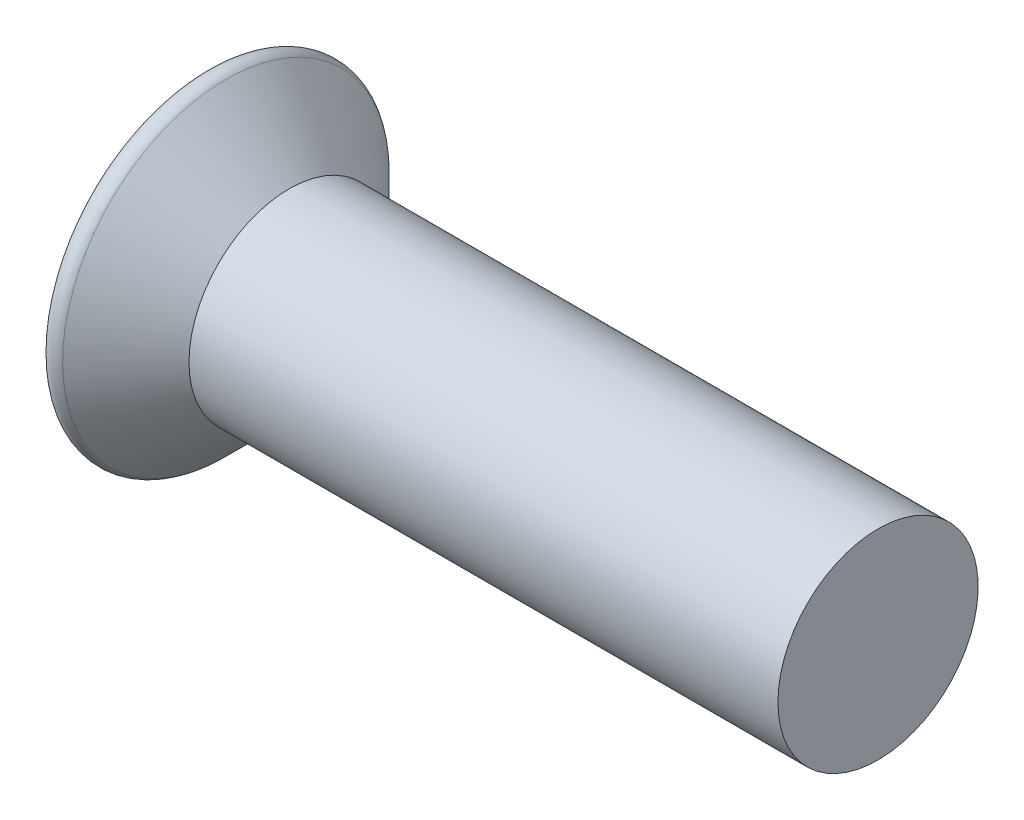
ISO-10303-21;
HEADER;
FILE_DESCRIPTION(('STEP AP214'),'2;1');
FILE_NAME('part.step','',(''),(''),'','','');
FILE_SCHEMA(('AUTOMOTIVE_DESIGN { 1 0 10303 214 1 1 1 1 }'));
ENDSEC;
DATA;
#1=APPLICATION_CONTEXT('core data for automotive mechanical design processes');
#2=APPLICATION_PROTOCOL_DEFINITION('international standard','automotive_design',2000,#1);
#3=PRODUCT_CONTEXT('',#1,'mechanical');
#4=PRODUCT('Part','Part','',(#3));
#5=PRODUCT_RELATED_PRODUCT_CATEGORY('part','',(#4));
#6=PRODUCT_DEFINITION_FORMATION('','',#4);
#7=PRODUCT_DEFINITION_CONTEXT('part definition',#1,'design');
#8=PRODUCT_DEFINITION('design','',#6,#7);
#9=PRODUCT_DEFINITION_SHAPE('','',#8);
#10=(LENGTH_UNIT() NAMED_UNIT(*) SI_UNIT(.MILLI.,.METRE.));
#11=(NAMED_UNIT(*) PLANE_ANGLE_UNIT() SI_UNIT($,.RADIAN.));
#12=(NAMED_UNIT(*) SI_UNIT($,.STERADIAN.) SOLID_ANGLE_UNIT());
#13=UNCERTAINTY_MEASURE_WITH_UNIT(LENGTH_MEASURE(1.E-05),#10,'distance_accuracy_value','');
#14=(GEOMETRIC_REPRESENTATION_CONTEXT(3) GLOBAL_UNCERTAINTY_ASSIGNED_CONTEXT((#13)) GLOBAL_UNIT_ASSIGNED_CONTEXT((#10,
#11,#12)) REPRESENTATION_CONTEXT('',''));
#15=CARTESIAN_POINT('',(0.,0.,0.));
#16=DIRECTION('',(0.,0.,1.));
#17=DIRECTION('',(1.,0.,0.));
#18=AXIS2_PLACEMENT_3D('',#15,#16,#17);
#19=CARTESIAN_POINT('',(-0.707106781186547,1.55710678118655,0.));
#20=DIRECTION('',(1.,0.,0.));
#21=DIRECTION('',(0.,0.,-1.));
#22=AXIS2_PLACEMENT_3D('',#19,#20,#21);
#23=PLANE('',#22);
#24=CARTESIAN_POINT('',(-0.707106781186547,0.,0.));
#25=DIRECTION('',(1.,0.,0.));
#26=DIRECTION('',(0.,0.,-1.));
#27=AXIS2_PLACEMENT_3D('',#24,#25,#26);
#28=CIRCLE('',#27,1.31568542494924);
#29=CARTESIAN_POINT('',(-0.707106781186547,0.,-1.31568542494924));
#30=VERTEX_POINT('',#29);
#31=EDGE_CURVE('E48',#30,#30,#28,.F.);
#32=ORIENTED_EDGE('',*,*,#31,.T.);
#33=EDGE_LOOP('',(#32));
#34=FACE_BOUND('',#33,.T.);
#35=DIRECTION('',(0.,-1.,0.));
#36=VECTOR('',#35,1.);
#37=CARTESIAN_POINT('',(-0.707106781186547,0.,0.116309347805293));
#38=LINE('',#37,#36);
#39=CARTESIAN_POINT('',(-0.707106781186547,-0.116309347805293,0.116309347805293));
#40=VERTEX_POINT('',#39);
#41=CARTESIAN_POINT('',(-0.707106781186547,-0.984908056771202,0.11630934780529));
#42=VERTEX_POINT('',#41);
#43=EDGE_CURVE('E55',#40,#42,#38,.T.);
#44=ORIENTED_EDGE('',*,*,#43,.T.);
#45=DIRECTION('',(0.,0.,1.));
#46=VECTOR('',#45,1.);
#47=CARTESIAN_POINT('',(-0.707106781186547,-0.984908056771202,0.));
#48=LINE('',#47,#46);
#49=CARTESIAN_POINT('',(-0.707106781186547,-0.984908056771202,-0.116309347805297));
#50=VERTEX_POINT('',#49);
#51=EDGE_CURVE('E190',#50,#42,#48,.T.);
#52=ORIENTED_EDGE('',*,*,#51,.F.);
#53=DIRECTION('',(0.,-1.,0.));
#54=VECTOR('',#53,1.);
#55=CARTESIAN_POINT('',(-0.707106781186547,0.,-0.116309347805293));
#56=LINE('',#55,#54);
#57=CARTESIAN_POINT('',(-0.707106781186547,-0.116309347805293,-0.116309347805293));
#58=VERTEX_POINT('',#57);
#59=EDGE_CURVE('E188',#58,#50,#56,.T.);
#60=ORIENTED_EDGE('',*,*,#59,.F.);
#61=DIRECTION('',(0.,0.,1.));
#62=VECTOR('',#61,1.);
#63=CARTESIAN_POINT('',(-0.707106781186547,-0.116309347805293,0.));
#64=LINE('',#63,#62);
#65=CARTESIAN_POINT('',(-0.707106781186547,-0.116309347805293,-0.984908056771202));
#66=VERTEX_POINT('',#65);
#67=EDGE_CURVE('E137',#66,#58,#64,.T.);
#68=ORIENTED_EDGE('',*,*,#67,.F.);
#69=DIRECTION('',(0.,1.,0.));
#70=VECTOR('',#69,1.);
#71=CARTESIAN_POINT('',(-0.707106781186547,0.,-0.984908056771202));
#72=LINE('',#71,#70);
#73=CARTESIAN_POINT('',(-0.707106781186547,0.116309347805293,-0.984908056771202));
#74=VERTEX_POINT('',#73);
#75=EDGE_CURVE('E184',#66,#74,#72,.T.);
#76=ORIENTED_EDGE('',*,*,#75,.T.);
#77=DIRECTION('',(0.,0.,1.));
#78=VECTOR('',#77,1.);
#79=CARTESIAN_POINT('',(-0.707106781186547,0.116309347805293,0.));
#80=LINE('',#79,#78);
#81=CARTESIAN_POINT('',(-0.707106781186547,0.116309347805293,-0.116309347805293));
#82=VERTEX_POINT('',#81);
#83=EDGE_CURVE('E181',#74,#82,#80,.T.);
#84=ORIENTED_EDGE('',*,*,#83,.T.);
#85=DIRECTION('',(0.,-1.,0.));
#86=VECTOR('',#85,1.);
#87=CARTESIAN_POINT('',(-0.707106781186547,0.,-0.116309347805293));
#88=LINE('',#87,#86);
#89=CARTESIAN_POINT('',(-0.707106781186547,0.984908056771202,-0.11630934780529));
#90=VERTEX_POINT('',#89);
#91=EDGE_CURVE('E178',#90,#82,#88,.T.);
#92=ORIENTED_EDGE('',*,*,#91,.F.);
#93=DIRECTION('',(0.,0.,1.));
#94=VECTOR('',#93,1.);
#95=CARTESIAN_POINT('',(-0.707106781186547,0.984908056771202,0.));
#96=LINE('',#95,#94);
#97=CARTESIAN_POINT('',(-0.707106781186547,0.984908056771202,0.116309347805297));
#98=VERTEX_POINT('',#97);
#99=EDGE_CURVE('E175',#90,#98,#96,.T.);
#100=ORIENTED_EDGE('',*,*,#99,.T.);
#101=DIRECTION('',(0.,-1.,0.));
#102=VECTOR('',#101,1.);
#103=CARTESIAN_POINT('',(-0.707106781186547,0.,0.116309347805293));
#104=LINE('',#103,#102);
#105=CARTESIAN_POINT('',(-0.707106781186547,0.116309347805293,0.116309347805293));
#106=VERTEX_POINT('',#105);
#107=EDGE_CURVE('E172',#98,#106,#104,.T.);
#108=ORIENTED_EDGE('',*,*,#107,.T.);
#109=DIRECTION('',(0.,0.,1.));
#110=VECTOR('',#109,1.);
#111=CARTESIAN_POINT('',(-0.707106781186547,0.116309347805293,0.));
#112=LINE('',#111,#110);
#113=CARTESIAN_POINT('',(-0.707106781186547,0.116309347805293,0.984908056771202));
#114=VERTEX_POINT('',#113);
#115=EDGE_CURVE('E169',#106,#114,#112,.T.);
#116=ORIENTED_EDGE('',*,*,#115,.T.);
#117=DIRECTION('',(0.,1.,0.));
#118=VECTOR('',#117,1.);
#119=CARTESIAN_POINT('',(-0.707106781186547,0.,0.984908056771202));
#120=LINE('',#119,#118);
#121=CARTESIAN_POINT('',(-0.707106781186547,-0.116309347805293,0.984908056771202));
#122=VERTEX_POINT('',#121);
#123=EDGE_CURVE('E166',#122,#114,#120,.T.);
#124=ORIENTED_EDGE('',*,*,#123,.F.);
#125=DIRECTION('',(0.,0.,1.));
#126=VECTOR('',#125,1.);
#127=CARTESIAN_POINT('',(-0.707106781186547,-0.116309347805293,0.));
#128=LINE('',#127,#126);
#129=EDGE_CURVE('E163',#40,#122,#128,.T.);
#130=ORIENTED_EDGE('',*,*,#129,.F.);
#131=EDGE_LOOP('',(#44,#52,#60,#68,#76,#84,#92,#100,#108,#116,#124,#130));
#132=FACE_BOUND('',#131,.T.);
#133=ADVANCED_FACE('F40',(#34,#132),#23,.F.);
#134=CARTESIAN_POINT('',(5.,0.,0.));
#135=DIRECTION('',(-1.,0.,0.));
#136=DIRECTION('',(0.,0.,1.));
#137=AXIS2_PLACEMENT_3D('',#134,#135,#136);
#138=PLANE('',#137);
#139=CARTESIAN_POINT('',(5.,0.,0.));
#140=DIRECTION('',(-1.,0.,0.));
#141=DIRECTION('',(0.,0.,1.));
#142=AXIS2_PLACEMENT_3D('',#139,#140,#141);
#143=CIRCLE('',#142,0.85);
#144=CARTESIAN_POINT('',(5.,0.,0.85));
#145=VERTEX_POINT('',#144);
#146=EDGE_CURVE('E213',#145,#145,#143,.T.);
#147=ORIENTED_EDGE('',*,*,#146,.F.);
#148=EDGE_LOOP('',(#147));
#149=FACE_BOUND('',#148,.T.);
#150=ADVANCED_FACE('F229',(#149),#138,.F.);
#151=CARTESIAN_POINT('',(-0.707106781186547,0.,0.));
#152=DIRECTION('',(-1.,0.,0.));
#153=DIRECTION('',(0.,0.,1.));
#154=AXIS2_PLACEMENT_3D('',#151,#152,#153);
#155=CYLINDRICAL_SURFACE('',#154,0.85);
#156=ORIENTED_EDGE('',*,*,#146,.T.);
#157=EDGE_LOOP('',(#156));
#158=FACE_BOUND('',#157,.T.);
#159=CARTESIAN_POINT('',(0.,0.,0.));
#160=DIRECTION('',(-1.,0.,0.));
#161=DIRECTION('',(0.,0.,1.));
#162=AXIS2_PLACEMENT_3D('',#159,#160,#161);
#163=CIRCLE('',#162,0.85);
#164=CARTESIAN_POINT('',(0.,0.,0.85));
#165=VERTEX_POINT('',#164);
#166=EDGE_CURVE('E193',#165,#165,#163,.T.);
#167=ORIENTED_EDGE('',*,*,#166,.F.);
#168=EDGE_LOOP('',(#167));
#169=FACE_BOUND('',#168,.T.);
#170=ADVANCED_FACE('F234',(#158,#169),#155,.T.);
#171=CARTESIAN_POINT('',(0.,0.,0.));
#172=DIRECTION('',(-1.,0.,0.));
#173=DIRECTION('',(0.,0.,1.));
#174=AXIS2_PLACEMENT_3D('',#171,#172,#173);
#175=CONICAL_SURFACE('',#174,0.85,0.785398163397448);
#176=CARTESIAN_POINT('',(-0.536396103067893,0.,0.));
#177=DIRECTION('',(1.,0.,0.));
#178=DIRECTION('',(0.,0.,-1.));
#179=AXIS2_PLACEMENT_3D('',#176,#177,#178);
#180=CIRCLE('',#179,1.38639610306789);
#181=CARTESIAN_POINT('',(-0.536396103067893,0.,-1.38639610306789));
#182=VERTEX_POINT('',#181);
#183=EDGE_CURVE('E11',#182,#182,#180,.T.);
#184=ORIENTED_EDGE('',*,*,#183,.T.);
#185=EDGE_LOOP('',(#184));
#186=FACE_BOUND('',#185,.T.);
#187=ORIENTED_EDGE('',*,*,#166,.T.);
#188=EDGE_LOOP('',(#187));
#189=FACE_BOUND('',#188,.T.);
#190=ADVANCED_FACE('F240',(#186,#189),#175,.T.);
#191=CARTESIAN_POINT('',(-0.507106781186547,0.,0.116309347805293));
#192=DIRECTION('',(0.,0.,-1.));
#193=DIRECTION('',(0.,1.,0.));
#194=AXIS2_PLACEMENT_3D('',#191,#192,#193);
#195=PLANE('',#194);
#196=ORIENTED_EDGE('',*,*,#43,.F.);
#197=DIRECTION('',(-1.,0.,0.));
#198=VECTOR('',#197,1.);
#199=CARTESIAN_POINT('',(-0.507106781186547,-0.116309347805293,0.116309347805293));
#200=LINE('',#199,#198);
#201=CARTESIAN_POINT('',(-0.507106781186547,-0.116309347805293,0.116309347805293));
#202=VERTEX_POINT('',#201);
#203=EDGE_CURVE('E103',#202,#40,#200,.T.);
#204=ORIENTED_EDGE('',*,*,#203,.F.);
#205=DIRECTION('',(0.,-1.,0.));
#206=VECTOR('',#205,1.);
#207=CARTESIAN_POINT('',(-0.507106781186547,0.,0.116309347805293));
#208=LINE('',#207,#206);
#209=CARTESIAN_POINT('',(-0.507106781186547,-0.984908056771202,0.11630934780529));
#210=VERTEX_POINT('',#209);
#211=EDGE_CURVE('E61',#202,#210,#208,.T.);
#212=ORIENTED_EDGE('',*,*,#211,.T.);
#213=DIRECTION('',(-1.,0.,0.));
#214=VECTOR('',#213,1.);
#215=CARTESIAN_POINT('',(-0.507106781186547,-0.984908056771202,0.11630934780529));
#216=LINE('',#215,#214);
#217=EDGE_CURVE('E99',#210,#42,#216,.T.);
#218=ORIENTED_EDGE('',*,*,#217,.T.);
#219=EDGE_LOOP('',(#196,#204,#212,#218));
#220=FACE_BOUND('',#219,.T.);
#221=ADVANCED_FACE('F238',(#220),#195,.T.);
#222=CARTESIAN_POINT('',(-0.507106781186547,-0.984908056771202,0.));
#223=DIRECTION('',(0.,-1.,0.));
#224=DIRECTION('',(0.,0.,-1.));
#225=AXIS2_PLACEMENT_3D('',#222,#223,#224);
#226=PLANE('',#225);
#227=ORIENTED_EDGE('',*,*,#51,.T.);
#228=ORIENTED_EDGE('',*,*,#217,.F.);
#229=DIRECTION('',(0.,0.,1.));
#230=VECTOR('',#229,1.);
#231=CARTESIAN_POINT('',(-0.507106781186547,-0.984908056771202,0.));
#232=LINE('',#231,#230);
#233=CARTESIAN_POINT('',(-0.507106781186547,-0.984908056771202,-0.116309347805297));
#234=VERTEX_POINT('',#233);
#235=EDGE_CURVE('E150',#234,#210,#232,.T.);
#236=ORIENTED_EDGE('',*,*,#235,.F.);
#237=DIRECTION('',(-1.,0.,0.));
#238=VECTOR('',#237,1.);
#239=CARTESIAN_POINT('',(-0.507106781186547,-0.984908056771202,-0.116309347805297));
#240=LINE('',#239,#238);
#241=EDGE_CURVE('E141',#234,#50,#240,.T.);
#242=ORIENTED_EDGE('',*,*,#241,.T.);
#243=EDGE_LOOP('',(#227,#228,#236,#242));
#244=FACE_BOUND('',#243,.T.);
#245=ADVANCED_FACE('F264',(#244),#226,.F.);
#246=CARTESIAN_POINT('',(-0.507106781186547,0.,-0.116309347805293));
#247=DIRECTION('',(0.,0.,-1.));
#248=DIRECTION('',(0.,1.,0.));
#249=AXIS2_PLACEMENT_3D('',#246,#247,#248);
#250=PLANE('',#249);
#251=ORIENTED_EDGE('',*,*,#59,.T.);
#252=ORIENTED_EDGE('',*,*,#241,.F.);
#253=DIRECTION('',(0.,-1.,0.));
#254=VECTOR('',#253,1.);
#255=CARTESIAN_POINT('',(-0.507106781186547,0.,-0.116309347805293));
#256=LINE('',#255,#254);
#257=CARTESIAN_POINT('',(-0.507106781186547,-0.116309347805293,-0.116309347805293));
#258=VERTEX_POINT('',#257);
#259=EDGE_CURVE('E145',#258,#234,#256,.T.);
#260=ORIENTED_EDGE('',*,*,#259,.F.);
#261=DIRECTION('',(-1.,0.,0.));
#262=VECTOR('',#261,1.);
#263=CARTESIAN_POINT('',(-0.507106781186547,-0.116309347805293,-0.116309347805293));
#264=LINE('',#263,#262);
#265=EDGE_CURVE('E131',#258,#58,#264,.T.);
#266=ORIENTED_EDGE('',*,*,#265,.T.);
#267=EDGE_LOOP('',(#251,#252,#260,#266));
#268=FACE_BOUND('',#267,.T.);
#269=ADVANCED_FACE('F146',(#268),#250,.F.);
#270=CARTESIAN_POINT('',(-0.507106781186547,-0.116309347805293,0.));
#271=DIRECTION('',(0.,-1.,0.));
#272=DIRECTION('',(0.,0.,-1.));
#273=AXIS2_PLACEMENT_3D('',#270,#271,#272);
#274=PLANE('',#273);
#275=ORIENTED_EDGE('',*,*,#67,.T.);
#276=ORIENTED_EDGE('',*,*,#265,.F.);
#277=DIRECTION('',(0.,0.,1.));
#278=VECTOR('',#277,1.);
#279=CARTESIAN_POINT('',(-0.507106781186547,-0.116309347805293,0.));
#280=LINE('',#279,#278);
#281=CARTESIAN_POINT('',(-0.507106781186547,-0.116309347805293,-0.984908056771202));
#282=VERTEX_POINT('',#281);
#283=EDGE_CURVE('E135',#282,#258,#280,.T.);
#284=ORIENTED_EDGE('',*,*,#283,.F.);
#285=DIRECTION('',(-1.,0.,0.));
#286=VECTOR('',#285,1.);
#287=CARTESIAN_POINT('',(-0.507106781186547,-0.116309347805293,-0.984908056771202));
#288=LINE('',#287,#286);
#289=EDGE_CURVE('E142',#282,#66,#288,.T.);
#290=ORIENTED_EDGE('',*,*,#289,.T.);
#291=EDGE_LOOP('',(#275,#276,#284,#290));
#292=FACE_BOUND('',#291,.T.);
#293=ADVANCED_FACE('F133',(#292),#274,.F.);
#294=CARTESIAN_POINT('',(-0.507106781186547,0.,-0.984908056771202));
#295=DIRECTION('',(0.,0.,1.));
#296=DIRECTION('',(1.,0.,0.));
#297=AXIS2_PLACEMENT_3D('',#294,#295,#296);
#298=PLANE('',#297);
#299=ORIENTED_EDGE('',*,*,#75,.F.);
#300=ORIENTED_EDGE('',*,*,#289,.F.);
#301=DIRECTION('',(0.,1.,0.));
#302=VECTOR('',#301,1.);
#303=CARTESIAN_POINT('',(-0.507106781186547,0.,-0.984908056771202));
#304=LINE('',#303,#302);
#305=CARTESIAN_POINT('',(-0.507106781186547,0.116309347805293,-0.984908056771202));
#306=VERTEX_POINT('',#305);
#307=EDGE_CURVE('E155',#282,#306,#304,.T.);
#308=ORIENTED_EDGE('',*,*,#307,.T.);
#309=DIRECTION('',(-1.,0.,0.));
#310=VECTOR('',#309,1.);
#311=CARTESIAN_POINT('',(-0.507106781186547,0.116309347805293,-0.984908056771202));
#312=LINE('',#311,#310);
#313=EDGE_CURVE('E196',#306,#74,#312,.T.);
#314=ORIENTED_EDGE('',*,*,#313,.T.);
#315=EDGE_LOOP('',(#299,#300,#308,#314));
#316=FACE_BOUND('',#315,.T.);
#317=ADVANCED_FACE('F283',(#316),#298,.T.);
#318=CARTESIAN_POINT('',(-0.507106781186547,0.116309347805293,0.));
#319=DIRECTION('',(0.,-1.,0.));
#320=DIRECTION('',(0.,0.,-1.));
#321=AXIS2_PLACEMENT_3D('',#318,#319,#320);
#322=PLANE('',#321);
#323=ORIENTED_EDGE('',*,*,#83,.F.);
#324=ORIENTED_EDGE('',*,*,#313,.F.);
#325=DIRECTION('',(0.,0.,1.));
#326=VECTOR('',#325,1.);
#327=CARTESIAN_POINT('',(-0.507106781186547,0.116309347805293,0.));
#328=LINE('',#327,#326);
#329=CARTESIAN_POINT('',(-0.507106781186547,0.116309347805293,-0.116309347805293));
#330=VERTEX_POINT('',#329);
#331=EDGE_CURVE('E157',#306,#330,#328,.T.);
#332=ORIENTED_EDGE('',*,*,#331,.T.);
#333=DIRECTION('',(-1.,0.,0.));
#334=VECTOR('',#333,1.);
#335=CARTESIAN_POINT('',(-0.507106781186547,0.116309347805293,-0.116309347805293));
#336=LINE('',#335,#334);
#337=EDGE_CURVE('E198',#330,#82,#336,.T.);
#338=ORIENTED_EDGE('',*,*,#337,.T.);
#339=EDGE_LOOP('',(#323,#324,#332,#338));
#340=FACE_BOUND('',#339,.T.);
#341=ADVANCED_FACE('F290',(#340),#322,.T.);
#342=CARTESIAN_POINT('',(-0.507106781186547,0.,-0.116309347805293));
#343=DIRECTION('',(0.,0.,-1.));
#344=DIRECTION('',(0.,1.,0.));
#345=AXIS2_PLACEMENT_3D('',#342,#343,#344);
#346=PLANE('',#345);
#347=ORIENTED_EDGE('',*,*,#91,.T.);
#348=ORIENTED_EDGE('',*,*,#337,.F.);
#349=DIRECTION('',(0.,-1.,0.));
#350=VECTOR('',#349,1.);
#351=CARTESIAN_POINT('',(-0.507106781186547,0.,-0.116309347805293));
#352=LINE('',#351,#350);
#353=CARTESIAN_POINT('',(-0.507106781186547,0.984908056771202,-0.11630934780529));
#354=VERTEX_POINT('',#353);
#355=EDGE_CURVE('E459',#354,#330,#352,.T.);
#356=ORIENTED_EDGE('',*,*,#355,.F.);
#357=DIRECTION('',(-1.,0.,0.));
#358=VECTOR('',#357,1.);
#359=CARTESIAN_POINT('',(-0.507106781186547,0.984908056771202,-0.11630934780529));
#360=LINE('',#359,#358);
#361=EDGE_CURVE('E200',#354,#90,#360,.T.);
#362=ORIENTED_EDGE('',*,*,#361,.T.);
#363=EDGE_LOOP('',(#347,#348,#356,#362));
#364=FACE_BOUND('',#363,.T.);
#365=ADVANCED_FACE('F298',(#364),#346,.F.);
#366=CARTESIAN_POINT('',(-0.507106781186547,0.984908056771202,0.));
#367=DIRECTION('',(0.,-1.,0.));
#368=DIRECTION('',(0.,0.,-1.));
#369=AXIS2_PLACEMENT_3D('',#366,#367,#368);
#370=PLANE('',#369);
#371=ORIENTED_EDGE('',*,*,#99,.F.);
#372=ORIENTED_EDGE('',*,*,#361,.F.);
#373=DIRECTION('',(0.,0.,1.));
#374=VECTOR('',#373,1.);
#375=CARTESIAN_POINT('',(-0.507106781186547,0.984908056771202,0.));
#376=LINE('',#375,#374);
#377=CARTESIAN_POINT('',(-0.507106781186547,0.984908056771202,0.116309347805297));
#378=VERTEX_POINT('',#377);
#379=EDGE_CURVE('E457',#354,#378,#376,.T.);
#380=ORIENTED_EDGE('',*,*,#379,.T.);
#381=DIRECTION('',(-1.,0.,0.));
#382=VECTOR('',#381,1.);
#383=CARTESIAN_POINT('',(-0.507106781186547,0.984908056771202,0.116309347805297));
#384=LINE('',#383,#382);
#385=EDGE_CURVE('E202',#378,#98,#384,.T.);
#386=ORIENTED_EDGE('',*,*,#385,.T.);
#387=EDGE_LOOP('',(#371,#372,#380,#386));
#388=FACE_BOUND('',#387,.T.);
#389=ADVANCED_FACE('F306',(#388),#370,.T.);
#390=CARTESIAN_POINT('',(-0.507106781186547,0.,0.116309347805293));
#391=DIRECTION('',(0.,0.,-1.));
#392=DIRECTION('',(0.,1.,0.));
#393=AXIS2_PLACEMENT_3D('',#390,#391,#392);
#394=PLANE('',#393);
#395=ORIENTED_EDGE('',*,*,#107,.F.);
#396=ORIENTED_EDGE('',*,*,#385,.F.);
#397=DIRECTION('',(0.,-1.,0.));
#398=VECTOR('',#397,1.);
#399=CARTESIAN_POINT('',(-0.507106781186547,0.,0.116309347805293));
#400=LINE('',#399,#398);
#401=CARTESIAN_POINT('',(-0.507106781186547,0.116309347805293,0.116309347805293));
#402=VERTEX_POINT('',#401);
#403=EDGE_CURVE('E455',#378,#402,#400,.T.);
#404=ORIENTED_EDGE('',*,*,#403,.T.);
#405=DIRECTION('',(-1.,0.,0.));
#406=VECTOR('',#405,1.);
#407=CARTESIAN_POINT('',(-0.507106781186547,0.116309347805293,0.116309347805293));
#408=LINE('',#407,#406);
#409=EDGE_CURVE('E204',#402,#106,#408,.T.);
#410=ORIENTED_EDGE('',*,*,#409,.T.);
#411=EDGE_LOOP('',(#395,#396,#404,#410));
#412=FACE_BOUND('',#411,.T.);
#413=ADVANCED_FACE('F314',(#412),#394,.T.);
#414=CARTESIAN_POINT('',(-0.507106781186547,0.116309347805293,0.));
#415=DIRECTION('',(0.,-1.,0.));
#416=DIRECTION('',(0.,0.,-1.));
#417=AXIS2_PLACEMENT_3D('',#414,#415,#416);
#418=PLANE('',#417);
#419=ORIENTED_EDGE('',*,*,#115,.F.);
#420=ORIENTED_EDGE('',*,*,#409,.F.);
#421=DIRECTION('',(0.,0.,1.));
#422=VECTOR('',#421,1.);
#423=CARTESIAN_POINT('',(-0.507106781186547,0.116309347805293,0.));
#424=LINE('',#423,#422);
#425=CARTESIAN_POINT('',(-0.507106781186547,0.116309347805293,0.984908056771202));
#426=VERTEX_POINT('',#425);
#427=EDGE_CURVE('E448',#402,#426,#424,.T.);
#428=ORIENTED_EDGE('',*,*,#427,.T.);
#429=DIRECTION('',(-1.,0.,0.));
#430=VECTOR('',#429,1.);
#431=CARTESIAN_POINT('',(-0.507106781186547,0.116309347805293,0.984908056771202));
#432=LINE('',#431,#430);
#433=EDGE_CURVE('E206',#426,#114,#432,.T.);
#434=ORIENTED_EDGE('',*,*,#433,.T.);
#435=EDGE_LOOP('',(#419,#420,#428,#434));
#436=FACE_BOUND('',#435,.T.);
#437=ADVANCED_FACE('F322',(#436),#418,.T.);
#438=CARTESIAN_POINT('',(-0.507106781186547,0.,0.984908056771202));
#439=DIRECTION('',(0.,0.,1.));
#440=DIRECTION('',(1.,0.,0.));
#441=AXIS2_PLACEMENT_3D('',#438,#439,#440);
#442=PLANE('',#441);
#443=ORIENTED_EDGE('',*,*,#123,.T.);
#444=ORIENTED_EDGE('',*,*,#433,.F.);
#445=DIRECTION('',(0.,1.,0.));
#446=VECTOR('',#445,1.);
#447=CARTESIAN_POINT('',(-0.507106781186547,0.,0.984908056771202));
#448=LINE('',#447,#446);
#449=CARTESIAN_POINT('',(-0.507106781186547,-0.116309347805293,0.984908056771202));
#450=VERTEX_POINT('',#449);
#451=EDGE_CURVE('E445',#450,#426,#448,.T.);
#452=ORIENTED_EDGE('',*,*,#451,.F.);
#453=DIRECTION('',(-1.,0.,0.));
#454=VECTOR('',#453,1.);
#455=CARTESIAN_POINT('',(-0.507106781186547,-0.116309347805293,0.984908056771202));
#456=LINE('',#455,#454);
#457=EDGE_CURVE('E208',#450,#122,#456,.T.);
#458=ORIENTED_EDGE('',*,*,#457,.T.);
#459=EDGE_LOOP('',(#443,#444,#452,#458));
#460=FACE_BOUND('',#459,.T.);
#461=ADVANCED_FACE('F330',(#460),#442,.F.);
#462=CARTESIAN_POINT('',(-0.507106781186547,-0.116309347805293,0.));
#463=DIRECTION('',(0.,-1.,0.));
#464=DIRECTION('',(0.,0.,-1.));
#465=AXIS2_PLACEMENT_3D('',#462,#463,#464);
#466=PLANE('',#465);
#467=ORIENTED_EDGE('',*,*,#129,.T.);
#468=ORIENTED_EDGE('',*,*,#457,.F.);
#469=DIRECTION('',(0.,0.,1.));
#470=VECTOR('',#469,1.);
#471=CARTESIAN_POINT('',(-0.507106781186547,-0.116309347805293,0.));
#472=LINE('',#471,#470);
#473=EDGE_CURVE('E449',#202,#450,#472,.T.);
#474=ORIENTED_EDGE('',*,*,#473,.F.);
#475=ORIENTED_EDGE('',*,*,#203,.T.);
#476=EDGE_LOOP('',(#467,#468,#474,#475));
#477=FACE_BOUND('',#476,.T.);
#478=ADVANCED_FACE('F225',(#477),#466,.F.);
#479=CARTESIAN_POINT('',(-0.507106781186547,0.,0.));
#480=DIRECTION('',(-1.,0.,0.));
#481=DIRECTION('',(0.,0.,1.));
#482=AXIS2_PLACEMENT_3D('',#479,#480,#481);
#483=PLANE('',#482);
#484=ORIENTED_EDGE('',*,*,#211,.F.);
#485=ORIENTED_EDGE('',*,*,#473,.T.);
#486=ORIENTED_EDGE('',*,*,#451,.T.);
#487=ORIENTED_EDGE('',*,*,#427,.F.);
#488=ORIENTED_EDGE('',*,*,#403,.F.);
#489=ORIENTED_EDGE('',*,*,#379,.F.);
#490=ORIENTED_EDGE('',*,*,#355,.T.);
#491=ORIENTED_EDGE('',*,*,#331,.F.);
#492=ORIENTED_EDGE('',*,*,#307,.F.);
#493=ORIENTED_EDGE('',*,*,#283,.T.);
#494=ORIENTED_EDGE('',*,*,#259,.T.);
#495=ORIENTED_EDGE('',*,*,#235,.T.);
#496=EDGE_LOOP('',(#484,#485,#486,#487,#488,#489,#490,#491,#492,#493,#494,#495));
#497=FACE_BOUND('',#496,.T.);
#498=ADVANCED_FACE('F153',(#497),#483,.T.);
#499=CARTESIAN_POINT('',(-0.607106781186547,0.,0.));
#500=DIRECTION('',(1.,0.,0.));
#501=DIRECTION('',(0.,0.,-1.));
#502=AXIS2_PLACEMENT_3D('',#499,#500,#501);
#503=TOROIDAL_SURFACE('',#502,1.31568542494924,0.1);
#504=ORIENTED_EDGE('',*,*,#183,.F.);
#505=EDGE_LOOP('',(#504));
#506=FACE_BOUND('',#505,.T.);
#507=ORIENTED_EDGE('',*,*,#31,.F.);
#508=EDGE_LOOP('',(#507));
#509=FACE_BOUND('',#508,.T.);
#510=ADVANCED_FACE('F42',(#506,#509),#503,.T.);
#511=CLOSED_SHELL('',(#133,#150,#170,#190,#221,#245,#269,#293,#317,#341,#365,#389,#413,#437,
#461,#478,#498,#510));
#512=MANIFOLD_SOLID_BREP('B2',#511);
#513=ADVANCED_BREP_SHAPE_REPRESENTATION('',(#18,#512),#14);
#514=SHAPE_DEFINITION_REPRESENTATION(#9,#513);
ENDSEC;
END-ISO-10303-21;
